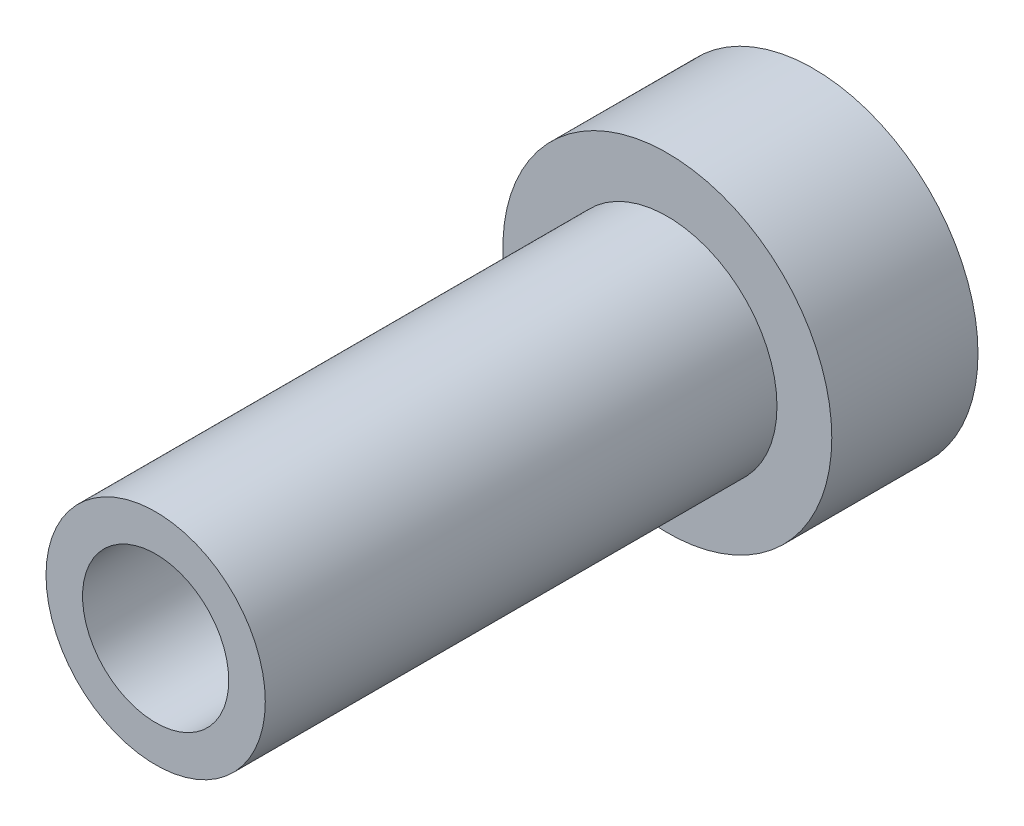
ISO-10303-21;
HEADER;
FILE_DESCRIPTION(('STEP AP214'),'2;1');
FILE_NAME('part.step','',(''),(''),'','','');
FILE_SCHEMA(('AUTOMOTIVE_DESIGN { 1 0 10303 214 1 1 1 1 }'));
ENDSEC;
DATA;
#1=APPLICATION_CONTEXT('core data for automotive mechanical design processes');
#2=APPLICATION_PROTOCOL_DEFINITION('international standard','automotive_design',2000,#1);
#3=PRODUCT_CONTEXT('',#1,'mechanical');
#4=PRODUCT('Part','Part','',(#3));
#5=PRODUCT_RELATED_PRODUCT_CATEGORY('part','',(#4));
#6=PRODUCT_DEFINITION_FORMATION('','',#4);
#7=PRODUCT_DEFINITION_CONTEXT('part definition',#1,'design');
#8=PRODUCT_DEFINITION('design','',#6,#7);
#9=PRODUCT_DEFINITION_SHAPE('','',#8);
#10=(LENGTH_UNIT() NAMED_UNIT(*) SI_UNIT(.MILLI.,.METRE.));
#11=(NAMED_UNIT(*) PLANE_ANGLE_UNIT() SI_UNIT($,.RADIAN.));
#12=(NAMED_UNIT(*) SI_UNIT($,.STERADIAN.) SOLID_ANGLE_UNIT());
#13=UNCERTAINTY_MEASURE_WITH_UNIT(LENGTH_MEASURE(1.E-05),#10,'distance_accuracy_value','');
#14=(GEOMETRIC_REPRESENTATION_CONTEXT(3) GLOBAL_UNCERTAINTY_ASSIGNED_CONTEXT((#13)) GLOBAL_UNIT_ASSIGNED_CONTEXT((#10,
#11,#12)) REPRESENTATION_CONTEXT('',''));
#15=CARTESIAN_POINT('',(0.,0.,0.));
#16=DIRECTION('',(0.,0.,1.));
#17=DIRECTION('',(1.,0.,0.));
#18=AXIS2_PLACEMENT_3D('',#15,#16,#17);
#19=CARTESIAN_POINT('',(0.,0.,2.));
#20=DIRECTION('',(0.,0.,-1.));
#21=DIRECTION('',(-1.,0.,0.));
#22=AXIS2_PLACEMENT_3D('',#19,#20,#21);
#23=CYLINDRICAL_SURFACE('',#22,2.25);
#24=CARTESIAN_POINT('',(0.,0.,2.));
#25=DIRECTION('',(0.,0.,1.));
#26=DIRECTION('',(1.,0.,0.));
#27=AXIS2_PLACEMENT_3D('',#24,#25,#26);
#28=CIRCLE('',#27,2.25);
#29=CARTESIAN_POINT('',(2.25,0.,2.));
#30=VERTEX_POINT('',#29);
#31=EDGE_CURVE('E40',#30,#30,#28,.T.);
#32=ORIENTED_EDGE('',*,*,#31,.F.);
#33=EDGE_LOOP('',(#32));
#34=FACE_BOUND('',#33,.T.);
#35=CARTESIAN_POINT('',(0.,0.,0.));
#36=DIRECTION('',(0.,0.,1.));
#37=DIRECTION('',(1.,0.,0.));
#38=AXIS2_PLACEMENT_3D('',#35,#36,#37);
#39=CIRCLE('',#38,2.25);
#40=CARTESIAN_POINT('',(2.25,0.,0.));
#41=VERTEX_POINT('',#40);
#42=EDGE_CURVE('E44',#41,#41,#39,.T.);
#43=ORIENTED_EDGE('',*,*,#42,.T.);
#44=EDGE_LOOP('',(#43));
#45=FACE_BOUND('',#44,.T.);
#46=ADVANCED_FACE('F34',(#34,#45),#23,.T.);
#47=CARTESIAN_POINT('',(0.,0.,2.));
#48=DIRECTION('',(0.,0.,1.));
#49=DIRECTION('',(1.,0.,0.));
#50=AXIS2_PLACEMENT_3D('',#47,#48,#49);
#51=PLANE('',#50);
#52=CARTESIAN_POINT('',(0.,0.,2.));
#53=DIRECTION('',(0.,0.,1.));
#54=DIRECTION('',(1.,0.,0.));
#55=AXIS2_PLACEMENT_3D('',#52,#53,#54);
#56=CIRCLE('',#55,1.5);
#57=CARTESIAN_POINT('',(1.5,0.,2.));
#58=VERTEX_POINT('',#57);
#59=EDGE_CURVE('E51',#58,#58,#56,.T.);
#60=ORIENTED_EDGE('',*,*,#59,.F.);
#61=EDGE_LOOP('',(#60));
#62=FACE_BOUND('',#61,.T.);
#63=ORIENTED_EDGE('',*,*,#31,.T.);
#64=EDGE_LOOP('',(#63));
#65=FACE_BOUND('',#64,.T.);
#66=ADVANCED_FACE('F74',(#62,#65),#51,.T.);
#67=CARTESIAN_POINT('',(0.,0.,0.));
#68=DIRECTION('',(0.,0.,1.));
#69=DIRECTION('',(1.,0.,0.));
#70=AXIS2_PLACEMENT_3D('',#67,#68,#69);
#71=PLANE('',#70);
#72=ORIENTED_EDGE('',*,*,#42,.F.);
#73=EDGE_LOOP('',(#72));
#74=FACE_BOUND('',#73,.T.);
#75=ADVANCED_FACE('F65',(#74),#71,.F.);
#76=CARTESIAN_POINT('',(0.,0.,9.));
#77=DIRECTION('',(0.,0.,1.));
#78=DIRECTION('',(1.,0.,0.));
#79=AXIS2_PLACEMENT_3D('',#76,#77,#78);
#80=PLANE('',#79);
#81=CARTESIAN_POINT('',(0.,0.,9.));
#82=DIRECTION('',(0.,0.,1.));
#83=DIRECTION('',(1.,0.,0.));
#84=AXIS2_PLACEMENT_3D('',#81,#82,#83);
#85=CIRCLE('',#84,1.5);
#86=CARTESIAN_POINT('',(1.5,0.,9.));
#87=VERTEX_POINT('',#86);
#88=EDGE_CURVE('E49',#87,#87,#85,.T.);
#89=ORIENTED_EDGE('',*,*,#88,.T.);
#90=EDGE_LOOP('',(#89));
#91=FACE_BOUND('',#90,.T.);
#92=CARTESIAN_POINT('',(0.,0.,9.));
#93=DIRECTION('',(0.,0.,1.));
#94=DIRECTION('',(1.,0.,0.));
#95=AXIS2_PLACEMENT_3D('',#92,#93,#94);
#96=CIRCLE('',#95,1.);
#97=CARTESIAN_POINT('',(1.,0.,9.));
#98=VERTEX_POINT('',#97);
#99=EDGE_CURVE('E54',#98,#98,#96,.T.);
#100=ORIENTED_EDGE('',*,*,#99,.F.);
#101=EDGE_LOOP('',(#100));
#102=FACE_BOUND('',#101,.T.);
#103=ADVANCED_FACE('F62',(#91,#102),#80,.T.);
#104=CARTESIAN_POINT('',(0.,0.,9.));
#105=DIRECTION('',(0.,0.,-1.));
#106=DIRECTION('',(-1.,0.,0.));
#107=AXIS2_PLACEMENT_3D('',#104,#105,#106);
#108=CYLINDRICAL_SURFACE('',#107,1.5);
#109=ORIENTED_EDGE('',*,*,#88,.F.);
#110=EDGE_LOOP('',(#109));
#111=FACE_BOUND('',#110,.T.);
#112=ORIENTED_EDGE('',*,*,#59,.T.);
#113=EDGE_LOOP('',(#112));
#114=FACE_BOUND('',#113,.T.);
#115=ADVANCED_FACE('F64',(#111,#114),#108,.T.);
#116=CARTESIAN_POINT('',(0.,0.,9.));
#117=DIRECTION('',(0.,0.,-1.));
#118=DIRECTION('',(-1.,0.,0.));
#119=AXIS2_PLACEMENT_3D('',#116,#117,#118);
#120=CYLINDRICAL_SURFACE('',#119,1.);
#121=ORIENTED_EDGE('',*,*,#99,.T.);
#122=EDGE_LOOP('',(#121));
#123=FACE_BOUND('',#122,.T.);
#124=CARTESIAN_POINT('',(0.,0.,2.));
#125=DIRECTION('',(0.,0.,1.));
#126=DIRECTION('',(1.,0.,0.));
#127=AXIS2_PLACEMENT_3D('',#124,#125,#126);
#128=CIRCLE('',#127,1.);
#129=CARTESIAN_POINT('',(1.,0.,2.));
#130=VERTEX_POINT('',#129);
#131=EDGE_CURVE('E10',#130,#130,#128,.F.);
#132=ORIENTED_EDGE('',*,*,#131,.T.);
#133=EDGE_LOOP('',(#132));
#134=FACE_BOUND('',#133,.T.);
#135=ADVANCED_FACE('F60',(#123,#134),#120,.F.);
#136=ORIENTED_EDGE('',*,*,#131,.F.);
#137=EDGE_LOOP('',(#136));
#138=FACE_BOUND('',#137,.T.);
#139=ADVANCED_FACE('F84',(#138),#51,.T.);
#140=CLOSED_SHELL('',(#46,#66,#75,#103,#115,#135,#139));
#141=MANIFOLD_SOLID_BREP('B2',#140);
#142=ADVANCED_BREP_SHAPE_REPRESENTATION('',(#18,#141),#14);
#143=SHAPE_DEFINITION_REPRESENTATION(#9,#142);
ENDSEC;
END-ISO-10303-21;
